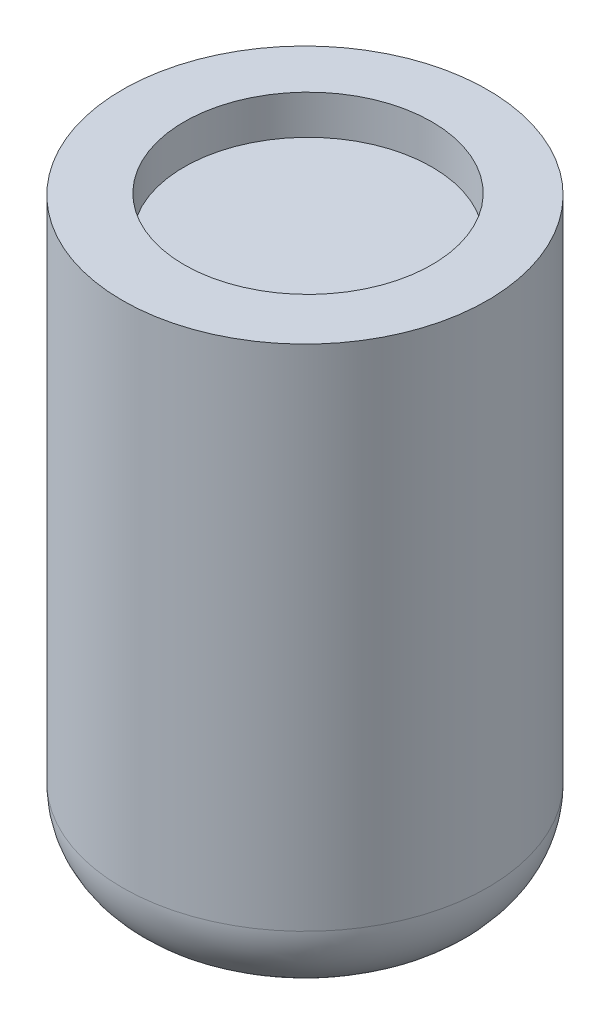
ISO-10303-21;
HEADER;
FILE_DESCRIPTION(('STEP AP214'),'2;1');
FILE_NAME('part.step','',(''),(''),'','','');
FILE_SCHEMA(('AUTOMOTIVE_DESIGN { 1 0 10303 214 1 1 1 1 }'));
ENDSEC;
DATA;
#1=APPLICATION_CONTEXT('core data for automotive mechanical design processes');
#2=APPLICATION_PROTOCOL_DEFINITION('international standard','automotive_design',2000,#1);
#3=PRODUCT_CONTEXT('',#1,'mechanical');
#4=PRODUCT('Part','Part','',(#3));
#5=PRODUCT_RELATED_PRODUCT_CATEGORY('part','',(#4));
#6=PRODUCT_DEFINITION_FORMATION('','',#4);
#7=PRODUCT_DEFINITION_CONTEXT('part definition',#1,'design');
#8=PRODUCT_DEFINITION('design','',#6,#7);
#9=PRODUCT_DEFINITION_SHAPE('','',#8);
#10=(LENGTH_UNIT() NAMED_UNIT(*) SI_UNIT(.MILLI.,.METRE.));
#11=(NAMED_UNIT(*) PLANE_ANGLE_UNIT() SI_UNIT($,.RADIAN.));
#12=(NAMED_UNIT(*) SI_UNIT($,.STERADIAN.) SOLID_ANGLE_UNIT());
#13=UNCERTAINTY_MEASURE_WITH_UNIT(LENGTH_MEASURE(1.E-05),#10,'distance_accuracy_value','');
#14=(GEOMETRIC_REPRESENTATION_CONTEXT(3) GLOBAL_UNCERTAINTY_ASSIGNED_CONTEXT((#13)) GLOBAL_UNIT_ASSIGNED_CONTEXT((#10,
#11,#12)) REPRESENTATION_CONTEXT('',''));
#15=CARTESIAN_POINT('',(0.,0.,0.));
#16=DIRECTION('',(0.,0.,1.));
#17=DIRECTION('',(1.,0.,0.));
#18=AXIS2_PLACEMENT_3D('',#15,#16,#17);
#19=CARTESIAN_POINT('',(0.,9.,0.));
#20=DIRECTION('',(0.,-1.,0.));
#21=DIRECTION('',(0.,0.,-1.));
#22=AXIS2_PLACEMENT_3D('',#19,#20,#21);
#23=CYLINDRICAL_SURFACE('',#22,2.8);
#24=CARTESIAN_POINT('',(0.,1.2,0.));
#25=DIRECTION('',(0.,1.,0.));
#26=DIRECTION('',(0.,0.,1.));
#27=AXIS2_PLACEMENT_3D('',#24,#25,#26);
#28=CIRCLE('',#27,2.8);
#29=CARTESIAN_POINT('',(0.,1.2,2.8));
#30=VERTEX_POINT('',#29);
#31=EDGE_CURVE('E45',#30,#30,#28,.T.);
#32=ORIENTED_EDGE('',*,*,#31,.T.);
#33=EDGE_LOOP('',(#32));
#34=FACE_BOUND('',#33,.T.);
#35=CARTESIAN_POINT('',(0.,9.,0.));
#36=DIRECTION('',(0.,1.,0.));
#37=DIRECTION('',(0.,0.,1.));
#38=AXIS2_PLACEMENT_3D('',#35,#36,#37);
#39=CIRCLE('',#38,2.8);
#40=CARTESIAN_POINT('',(0.,9.,2.8));
#41=VERTEX_POINT('',#40);
#42=EDGE_CURVE('E50',#41,#41,#39,.T.);
#43=ORIENTED_EDGE('',*,*,#42,.F.);
#44=EDGE_LOOP('',(#43));
#45=FACE_BOUND('',#44,.T.);
#46=ADVANCED_FACE('F37',(#34,#45),#23,.T.);
#47=CARTESIAN_POINT('',(0.,9.,0.));
#48=DIRECTION('',(0.,1.,0.));
#49=DIRECTION('',(0.,0.,1.));
#50=AXIS2_PLACEMENT_3D('',#47,#48,#49);
#51=PLANE('',#50);
#52=CARTESIAN_POINT('',(0.,9.,-0.0471541720390815));
#53=DIRECTION('',(0.,1.,0.));
#54=DIRECTION('',(0.,0.,1.));
#55=AXIS2_PLACEMENT_3D('',#52,#53,#54);
#56=CIRCLE('',#55,1.9);
#57=CARTESIAN_POINT('',(0.,9.,1.85284582796092));
#58=VERTEX_POINT('',#57);
#59=EDGE_CURVE('E58',#58,#58,#56,.T.);
#60=ORIENTED_EDGE('',*,*,#59,.F.);
#61=EDGE_LOOP('',(#60));
#62=FACE_BOUND('',#61,.T.);
#63=ORIENTED_EDGE('',*,*,#42,.T.);
#64=EDGE_LOOP('',(#63));
#65=FACE_BOUND('',#64,.T.);
#66=ADVANCED_FACE('F75',(#62,#65),#51,.T.);
#67=CARTESIAN_POINT('',(0.,0.,0.));
#68=DIRECTION('',(0.,1.,0.));
#69=DIRECTION('',(0.,0.,1.));
#70=AXIS2_PLACEMENT_3D('',#67,#68,#69);
#71=PLANE('',#70);
#72=CARTESIAN_POINT('',(0.,0.,0.));
#73=DIRECTION('',(0.,1.,0.));
#74=DIRECTION('',(0.,0.,1.));
#75=AXIS2_PLACEMENT_3D('',#72,#73,#74);
#76=CIRCLE('',#75,1.6);
#77=CARTESIAN_POINT('',(0.,0.,1.6));
#78=VERTEX_POINT('',#77);
#79=EDGE_CURVE('E10',#78,#78,#76,.F.);
#80=ORIENTED_EDGE('',*,*,#79,.T.);
#81=EDGE_LOOP('',(#80));
#82=FACE_BOUND('',#81,.T.);
#83=ADVANCED_FACE('F71',(#82),#71,.F.);
#84=CARTESIAN_POINT('',(0.,8.4,-0.0471541720390815));
#85=DIRECTION('',(0.,1.,0.));
#86=DIRECTION('',(0.,0.,1.));
#87=AXIS2_PLACEMENT_3D('',#84,#85,#86);
#88=CYLINDRICAL_SURFACE('',#87,1.9);
#89=CARTESIAN_POINT('',(0.,8.4,-0.0471541720390815));
#90=DIRECTION('',(0.,1.,0.));
#91=DIRECTION('',(0.,0.,1.));
#92=AXIS2_PLACEMENT_3D('',#89,#90,#91);
#93=CIRCLE('',#92,1.9);
#94=CARTESIAN_POINT('',(0.,8.4,1.85284582796092));
#95=VERTEX_POINT('',#94);
#96=EDGE_CURVE('E55',#95,#95,#93,.T.);
#97=ORIENTED_EDGE('',*,*,#96,.F.);
#98=EDGE_LOOP('',(#97));
#99=FACE_BOUND('',#98,.T.);
#100=ORIENTED_EDGE('',*,*,#59,.T.);
#101=EDGE_LOOP('',(#100));
#102=FACE_BOUND('',#101,.T.);
#103=ADVANCED_FACE('F68',(#99,#102),#88,.F.);
#104=CARTESIAN_POINT('',(0.,8.4,-0.0471541720390815));
#105=DIRECTION('',(0.,1.,0.));
#106=DIRECTION('',(0.,0.,1.));
#107=AXIS2_PLACEMENT_3D('',#104,#105,#106);
#108=PLANE('',#107);
#109=ORIENTED_EDGE('',*,*,#96,.T.);
#110=EDGE_LOOP('',(#109));
#111=FACE_BOUND('',#110,.T.);
#112=ADVANCED_FACE('F66',(#111),#108,.T.);
#113=CARTESIAN_POINT('',(0.,1.2,0.));
#114=DIRECTION('',(0.,1.,0.));
#115=DIRECTION('',(0.,0.,1.));
#116=AXIS2_PLACEMENT_3D('',#113,#114,#115);
#117=TOROIDAL_SURFACE('',#116,1.6,1.2);
#118=ORIENTED_EDGE('',*,*,#79,.F.);
#119=EDGE_LOOP('',(#118));
#120=FACE_BOUND('',#119,.T.);
#121=ORIENTED_EDGE('',*,*,#31,.F.);
#122=EDGE_LOOP('',(#121));
#123=FACE_BOUND('',#122,.T.);
#124=ADVANCED_FACE('F39',(#120,#123),#117,.T.);
#125=CLOSED_SHELL('',(#46,#66,#83,#103,#112,#124));
#126=MANIFOLD_SOLID_BREP('B2',#125);
#127=ADVANCED_BREP_SHAPE_REPRESENTATION('',(#18,#126),#14);
#128=SHAPE_DEFINITION_REPRESENTATION(#9,#127);
ENDSEC;
END-ISO-10303-21;
